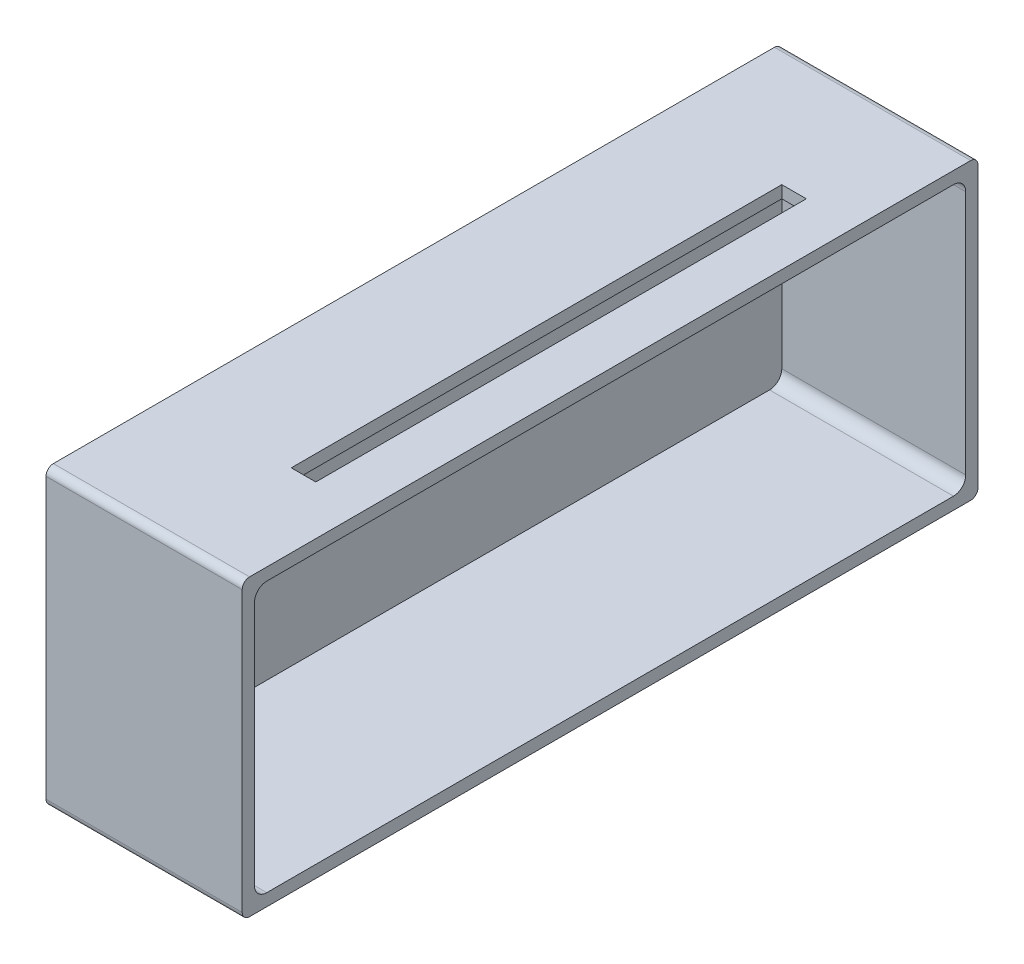
ISO-10303-21;
HEADER;
FILE_DESCRIPTION(('STEP AP214'),'2;1');
FILE_NAME('part.step','',(''),(''),'','','');
FILE_SCHEMA(('AUTOMOTIVE_DESIGN { 1 0 10303 214 1 1 1 1 }'));
ENDSEC;
DATA;
#1=APPLICATION_CONTEXT('core data for automotive mechanical design processes');
#2=APPLICATION_PROTOCOL_DEFINITION('international standard','automotive_design',2000,#1);
#3=PRODUCT_CONTEXT('',#1,'mechanical');
#4=PRODUCT('Part','Part','',(#3));
#5=PRODUCT_RELATED_PRODUCT_CATEGORY('part','',(#4));
#6=PRODUCT_DEFINITION_FORMATION('','',#4);
#7=PRODUCT_DEFINITION_CONTEXT('part definition',#1,'design');
#8=PRODUCT_DEFINITION('design','',#6,#7);
#9=PRODUCT_DEFINITION_SHAPE('','',#8);
#10=(LENGTH_UNIT() NAMED_UNIT(*) SI_UNIT(.MILLI.,.METRE.));
#11=(NAMED_UNIT(*) PLANE_ANGLE_UNIT() SI_UNIT($,.RADIAN.));
#12=(NAMED_UNIT(*) SI_UNIT($,.STERADIAN.) SOLID_ANGLE_UNIT());
#13=UNCERTAINTY_MEASURE_WITH_UNIT(LENGTH_MEASURE(1.E-05),#10,'distance_accuracy_value','');
#14=(GEOMETRIC_REPRESENTATION_CONTEXT(3) GLOBAL_UNCERTAINTY_ASSIGNED_CONTEXT((#13)) GLOBAL_UNIT_ASSIGNED_CONTEXT((#10,
#11,#12)) REPRESENTATION_CONTEXT('',''));
#15=CARTESIAN_POINT('',(0.,0.,0.));
#16=DIRECTION('',(0.,0.,1.));
#17=DIRECTION('',(1.,0.,0.));
#18=AXIS2_PLACEMENT_3D('',#15,#16,#17);
#19=CARTESIAN_POINT('',(80.,127.850176246966,146.991542380905));
#20=DIRECTION('',(0.,0.,-1.));
#21=DIRECTION('',(-1.,0.,0.));
#22=AXIS2_PLACEMENT_3D('',#19,#20,#21);
#23=PLANE('',#22);
#24=DIRECTION('',(0.,-1.,0.));
#25=VECTOR('',#24,1.);
#26=CARTESIAN_POINT('',(0.,127.850176246966,146.991542380905));
#27=LINE('',#26,#25);
#28=CARTESIAN_POINT('',(0.,124.850176246966,146.991542380905));
#29=VERTEX_POINT('',#28);
#30=CARTESIAN_POINT('',(0.,10.8501762469659,146.991542380905));
#31=VERTEX_POINT('',#30);
#32=EDGE_CURVE('E264',#29,#31,#27,.T.);
#33=ORIENTED_EDGE('',*,*,#32,.T.);
#34=DIRECTION('',(-1.,0.,0.));
#35=VECTOR('',#34,1.);
#36=CARTESIAN_POINT('',(80.,10.8501762469659,146.991542380905));
#37=LINE('',#36,#35);
#38=CARTESIAN_POINT('',(80.,10.8501762469659,146.991542380905));
#39=VERTEX_POINT('',#38);
#40=EDGE_CURVE('E338',#31,#39,#37,.F.);
#41=ORIENTED_EDGE('',*,*,#40,.T.);
#42=DIRECTION('',(0.,-1.,0.));
#43=VECTOR('',#42,1.);
#44=CARTESIAN_POINT('',(80.,127.850176246966,146.991542380905));
#45=LINE('',#44,#43);
#46=CARTESIAN_POINT('',(80.,124.850176246966,146.991542380905));
#47=VERTEX_POINT('',#46);
#48=EDGE_CURVE('E265',#47,#39,#45,.T.);
#49=ORIENTED_EDGE('',*,*,#48,.F.);
#50=DIRECTION('',(-1.,0.,0.));
#51=VECTOR('',#50,1.);
#52=CARTESIAN_POINT('',(80.,124.850176246966,146.991542380905));
#53=LINE('',#52,#51);
#54=EDGE_CURVE('E334',#47,#29,#53,.T.);
#55=ORIENTED_EDGE('',*,*,#54,.T.);
#56=EDGE_LOOP('',(#33,#41,#49,#55));
#57=FACE_BOUND('',#56,.T.);
#58=ADVANCED_FACE('F47',(#57),#23,.F.);
#59=CARTESIAN_POINT('',(80.,7.85017624696593,146.991542380905));
#60=DIRECTION('',(0.,1.,0.));
#61=DIRECTION('',(0.,0.,1.));
#62=AXIS2_PLACEMENT_3D('',#59,#60,#61);
#63=PLANE('',#62);
#64=DIRECTION('',(0.,0.,-1.));
#65=VECTOR('',#64,1.);
#66=CARTESIAN_POINT('',(0.,7.85017624696593,146.991542380905));
#67=LINE('',#66,#65);
#68=CARTESIAN_POINT('',(0.,7.85017624696593,143.991542380905));
#69=VERTEX_POINT('',#68);
#70=CARTESIAN_POINT('',(0.,7.85017624696593,-150.008457619095));
#71=VERTEX_POINT('',#70);
#72=EDGE_CURVE('E286',#69,#71,#67,.T.);
#73=ORIENTED_EDGE('',*,*,#72,.T.);
#74=DIRECTION('',(-1.,0.,0.));
#75=VECTOR('',#74,1.);
#76=CARTESIAN_POINT('',(80.,7.85017624696593,-150.008457619095));
#77=LINE('',#76,#75);
#78=CARTESIAN_POINT('',(80.,7.85017624696593,-150.008457619095));
#79=VERTEX_POINT('',#78);
#80=EDGE_CURVE('E319',#71,#79,#77,.F.);
#81=ORIENTED_EDGE('',*,*,#80,.T.);
#82=DIRECTION('',(0.,0.,-1.));
#83=VECTOR('',#82,1.);
#84=CARTESIAN_POINT('',(80.,7.85017624696593,146.991542380905));
#85=LINE('',#84,#83);
#86=CARTESIAN_POINT('',(80.,7.85017624696593,143.991542380905));
#87=VERTEX_POINT('',#86);
#88=EDGE_CURVE('E269',#87,#79,#85,.T.);
#89=ORIENTED_EDGE('',*,*,#88,.F.);
#90=DIRECTION('',(-1.,0.,0.));
#91=VECTOR('',#90,1.);
#92=CARTESIAN_POINT('',(80.,7.85017624696593,143.991542380905));
#93=LINE('',#92,#91);
#94=EDGE_CURVE('E315',#87,#69,#93,.T.);
#95=ORIENTED_EDGE('',*,*,#94,.T.);
#96=EDGE_LOOP('',(#73,#81,#89,#95));
#97=FACE_BOUND('',#96,.T.);
#98=ADVANCED_FACE('F440',(#97),#63,.F.);
#99=CARTESIAN_POINT('',(80.,127.850176246966,-153.008457619095));
#100=DIRECTION('',(0.,0.,1.));
#101=DIRECTION('',(0.,-1.,0.));
#102=AXIS2_PLACEMENT_3D('',#99,#100,#101);
#103=PLANE('',#102);
#104=DIRECTION('',(0.,1.,0.));
#105=VECTOR('',#104,1.);
#106=CARTESIAN_POINT('',(80.,127.850176246966,-153.008457619095));
#107=LINE('',#106,#105);
#108=CARTESIAN_POINT('',(80.,10.8501762469659,-153.008457619095));
#109=VERTEX_POINT('',#108);
#110=CARTESIAN_POINT('',(80.,124.850176246966,-153.008457619095));
#111=VERTEX_POINT('',#110);
#112=EDGE_CURVE('E274',#109,#111,#107,.T.);
#113=ORIENTED_EDGE('',*,*,#112,.F.);
#114=DIRECTION('',(-1.,0.,0.));
#115=VECTOR('',#114,1.);
#116=CARTESIAN_POINT('',(80.,10.8501762469659,-153.008457619095));
#117=LINE('',#116,#115);
#118=CARTESIAN_POINT('',(0.,10.8501762469659,-153.008457619095));
#119=VERTEX_POINT('',#118);
#120=EDGE_CURVE('E299',#109,#119,#117,.T.);
#121=ORIENTED_EDGE('',*,*,#120,.T.);
#122=DIRECTION('',(0.,1.,0.));
#123=VECTOR('',#122,1.);
#124=CARTESIAN_POINT('',(0.,127.850176246966,-153.008457619095));
#125=LINE('',#124,#123);
#126=CARTESIAN_POINT('',(0.,124.850176246966,-153.008457619095));
#127=VERTEX_POINT('',#126);
#128=EDGE_CURVE('E290',#119,#127,#125,.T.);
#129=ORIENTED_EDGE('',*,*,#128,.T.);
#130=DIRECTION('',(-1.,0.,0.));
#131=VECTOR('',#130,1.);
#132=CARTESIAN_POINT('',(80.,124.850176246966,-153.008457619095));
#133=LINE('',#132,#131);
#134=EDGE_CURVE('E282',#127,#111,#133,.F.);
#135=ORIENTED_EDGE('',*,*,#134,.T.);
#136=EDGE_LOOP('',(#113,#121,#129,#135));
#137=FACE_BOUND('',#136,.T.);
#138=ADVANCED_FACE('F446',(#137),#103,.F.);
#139=CARTESIAN_POINT('',(80.,127.850176246966,146.991542380905));
#140=DIRECTION('',(0.,-1.,0.));
#141=DIRECTION('',(0.,0.,-1.));
#142=AXIS2_PLACEMENT_3D('',#139,#140,#141);
#143=PLANE('',#142);
#144=DIRECTION('',(1.,0.,0.));
#145=VECTOR('',#144,1.);
#146=CARTESIAN_POINT('',(50.,127.850176246966,96.9915423809052));
#147=LINE('',#146,#145);
#148=CARTESIAN_POINT('',(50.,127.850176246966,96.9915423809052));
#149=VERTEX_POINT('',#148);
#150=CARTESIAN_POINT('',(60.,127.850176246966,96.9915423809052));
#151=VERTEX_POINT('',#150);
#152=EDGE_CURVE('E218',#149,#151,#147,.T.);
#153=ORIENTED_EDGE('',*,*,#152,.F.);
#154=DIRECTION('',(0.,0.,1.));
#155=VECTOR('',#154,1.);
#156=CARTESIAN_POINT('',(50.,127.850176246966,-103.008457619095));
#157=LINE('',#156,#155);
#158=CARTESIAN_POINT('',(50.,127.850176246966,-103.008457619095));
#159=VERTEX_POINT('',#158);
#160=EDGE_CURVE('E63',#159,#149,#157,.T.);
#161=ORIENTED_EDGE('',*,*,#160,.F.);
#162=DIRECTION('',(-1.,0.,0.));
#163=VECTOR('',#162,1.);
#164=CARTESIAN_POINT('',(50.,127.850176246966,-103.008457619095));
#165=LINE('',#164,#163);
#166=CARTESIAN_POINT('',(60.,127.850176246966,-103.008457619095));
#167=VERTEX_POINT('',#166);
#168=EDGE_CURVE('E205',#167,#159,#165,.T.);
#169=ORIENTED_EDGE('',*,*,#168,.F.);
#170=DIRECTION('',(0.,0.,-1.));
#171=VECTOR('',#170,1.);
#172=CARTESIAN_POINT('',(60.,127.850176246966,-103.008457619095));
#173=LINE('',#172,#171);
#174=EDGE_CURVE('E209',#151,#167,#173,.T.);
#175=ORIENTED_EDGE('',*,*,#174,.F.);
#176=EDGE_LOOP('',(#153,#161,#169,#175));
#177=FACE_BOUND('',#176,.T.);
#178=DIRECTION('',(0.,0.,1.));
#179=VECTOR('',#178,1.);
#180=CARTESIAN_POINT('',(80.,127.850176246966,146.991542380905));
#181=LINE('',#180,#179);
#182=CARTESIAN_POINT('',(80.,127.850176246966,-150.008457619095));
#183=VERTEX_POINT('',#182);
#184=CARTESIAN_POINT('',(80.,127.850176246966,143.991542380905));
#185=VERTEX_POINT('',#184);
#186=EDGE_CURVE('E278',#183,#185,#181,.T.);
#187=ORIENTED_EDGE('',*,*,#186,.F.);
#188=DIRECTION('',(-1.,0.,0.));
#189=VECTOR('',#188,1.);
#190=CARTESIAN_POINT('',(80.,127.850176246966,-150.008457619095));
#191=LINE('',#190,#189);
#192=CARTESIAN_POINT('',(0.,127.850176246966,-150.008457619095));
#193=VERTEX_POINT('',#192);
#194=EDGE_CURVE('E344',#183,#193,#191,.T.);
#195=ORIENTED_EDGE('',*,*,#194,.T.);
#196=DIRECTION('',(0.,0.,1.));
#197=VECTOR('',#196,1.);
#198=CARTESIAN_POINT('',(0.,127.850176246966,146.991542380905));
#199=LINE('',#198,#197);
#200=CARTESIAN_POINT('',(0.,127.850176246966,143.991542380905));
#201=VERTEX_POINT('',#200);
#202=EDGE_CURVE('E270',#193,#201,#199,.T.);
#203=ORIENTED_EDGE('',*,*,#202,.T.);
#204=DIRECTION('',(-1.,0.,0.));
#205=VECTOR('',#204,1.);
#206=CARTESIAN_POINT('',(80.,127.850176246966,143.991542380905));
#207=LINE('',#206,#205);
#208=EDGE_CURVE('E341',#201,#185,#207,.F.);
#209=ORIENTED_EDGE('',*,*,#208,.T.);
#210=EDGE_LOOP('',(#187,#195,#203,#209));
#211=FACE_BOUND('',#210,.T.);
#212=ADVANCED_FACE('F492',(#177,#211),#143,.F.);
#213=CARTESIAN_POINT('',(80.,0.,0.));
#214=DIRECTION('',(1.,0.,0.));
#215=DIRECTION('',(0.,0.,-1.));
#216=AXIS2_PLACEMENT_3D('',#213,#214,#215);
#217=PLANE('',#216);
#218=DIRECTION('',(0.,0.,-1.));
#219=VECTOR('',#218,1.);
#220=CARTESIAN_POINT('',(80.,12.8501762469659,146.991542380905));
#221=LINE('',#220,#219);
#222=CARTESIAN_POINT('',(80.,12.8501762469659,136.991542380905));
#223=VERTEX_POINT('',#222);
#224=CARTESIAN_POINT('',(80.,12.8501762469659,-143.008457619095));
#225=VERTEX_POINT('',#224);
#226=EDGE_CURVE('E252',#223,#225,#221,.T.);
#227=ORIENTED_EDGE('',*,*,#226,.F.);
#228=CARTESIAN_POINT('',(80.,17.8501762469659,136.991542380905));
#229=DIRECTION('',(1.,0.,0.));
#230=DIRECTION('',(0.,0.,-1.));
#231=AXIS2_PLACEMENT_3D('',#228,#229,#230);
#232=CIRCLE('',#231,5.);
#233=CARTESIAN_POINT('',(80.,17.8501762469659,141.991542380905));
#234=VERTEX_POINT('',#233);
#235=EDGE_CURVE('E388',#223,#234,#232,.F.);
#236=ORIENTED_EDGE('',*,*,#235,.T.);
#237=DIRECTION('',(0.,-1.,0.));
#238=VECTOR('',#237,1.);
#239=CARTESIAN_POINT('',(80.,127.850176246966,141.991542380905));
#240=LINE('',#239,#238);
#241=CARTESIAN_POINT('',(80.,117.850176246966,141.991542380905));
#242=VERTEX_POINT('',#241);
#243=EDGE_CURVE('E248',#242,#234,#240,.T.);
#244=ORIENTED_EDGE('',*,*,#243,.F.);
#245=CARTESIAN_POINT('',(80.,117.850176246966,136.991542380905));
#246=DIRECTION('',(1.,0.,0.));
#247=DIRECTION('',(0.,0.,-1.));
#248=AXIS2_PLACEMENT_3D('',#245,#246,#247);
#249=CIRCLE('',#248,5.);
#250=CARTESIAN_POINT('',(80.,122.850176246966,136.991542380905));
#251=VERTEX_POINT('',#250);
#252=EDGE_CURVE('E11',#242,#251,#249,.F.);
#253=ORIENTED_EDGE('',*,*,#252,.T.);
#254=DIRECTION('',(0.,0.,1.));
#255=VECTOR('',#254,1.);
#256=CARTESIAN_POINT('',(80.,122.850176246966,146.991542380905));
#257=LINE('',#256,#255);
#258=CARTESIAN_POINT('',(80.,122.850176246966,-143.008457619095));
#259=VERTEX_POINT('',#258);
#260=EDGE_CURVE('E260',#259,#251,#257,.T.);
#261=ORIENTED_EDGE('',*,*,#260,.F.);
#262=CARTESIAN_POINT('',(80.,117.850176246966,-143.008457619095));
#263=DIRECTION('',(1.,0.,0.));
#264=DIRECTION('',(0.,0.,-1.));
#265=AXIS2_PLACEMENT_3D('',#262,#263,#264);
#266=CIRCLE('',#265,5.);
#267=CARTESIAN_POINT('',(80.,117.850176246966,-148.008457619095));
#268=VERTEX_POINT('',#267);
#269=EDGE_CURVE('E56',#259,#268,#266,.F.);
#270=ORIENTED_EDGE('',*,*,#269,.T.);
#271=DIRECTION('',(0.,1.,0.));
#272=VECTOR('',#271,1.);
#273=CARTESIAN_POINT('',(80.,127.850176246966,-148.008457619095));
#274=LINE('',#273,#272);
#275=CARTESIAN_POINT('',(80.,17.8501762469659,-148.008457619095));
#276=VERTEX_POINT('',#275);
#277=EDGE_CURVE('E256',#276,#268,#274,.T.);
#278=ORIENTED_EDGE('',*,*,#277,.F.);
#279=CARTESIAN_POINT('',(80.,17.8501762469659,-143.008457619095));
#280=DIRECTION('',(1.,0.,0.));
#281=DIRECTION('',(0.,0.,-1.));
#282=AXIS2_PLACEMENT_3D('',#279,#280,#281);
#283=CIRCLE('',#282,5.);
#284=EDGE_CURVE('E391',#276,#225,#283,.F.);
#285=ORIENTED_EDGE('',*,*,#284,.T.);
#286=EDGE_LOOP('',(#227,#236,#244,#253,#261,#270,#278,#285));
#287=FACE_BOUND('',#286,.T.);
#288=ORIENTED_EDGE('',*,*,#88,.T.);
#289=CARTESIAN_POINT('',(80.,10.8501762469659,-150.008457619095));
#290=DIRECTION('',(1.,0.,0.));
#291=DIRECTION('',(0.,0.,-1.));
#292=AXIS2_PLACEMENT_3D('',#289,#290,#291);
#293=CIRCLE('',#292,3.);
#294=EDGE_CURVE('E331',#79,#109,#293,.T.);
#295=ORIENTED_EDGE('',*,*,#294,.T.);
#296=ORIENTED_EDGE('',*,*,#112,.T.);
#297=CARTESIAN_POINT('',(80.,124.850176246966,-150.008457619095));
#298=DIRECTION('',(1.,0.,0.));
#299=DIRECTION('',(0.,0.,-1.));
#300=AXIS2_PLACEMENT_3D('',#297,#298,#299);
#301=CIRCLE('',#300,3.);
#302=EDGE_CURVE('E325',#111,#183,#301,.T.);
#303=ORIENTED_EDGE('',*,*,#302,.T.);
#304=ORIENTED_EDGE('',*,*,#186,.T.);
#305=CARTESIAN_POINT('',(80.,124.850176246966,143.991542380905));
#306=DIRECTION('',(1.,0.,0.));
#307=DIRECTION('',(0.,0.,-1.));
#308=AXIS2_PLACEMENT_3D('',#305,#306,#307);
#309=CIRCLE('',#308,3.);
#310=EDGE_CURVE('E322',#185,#47,#309,.T.);
#311=ORIENTED_EDGE('',*,*,#310,.T.);
#312=ORIENTED_EDGE('',*,*,#48,.T.);
#313=CARTESIAN_POINT('',(80.,10.8501762469659,143.991542380905));
#314=DIRECTION('',(1.,0.,0.));
#315=DIRECTION('',(0.,0.,-1.));
#316=AXIS2_PLACEMENT_3D('',#313,#314,#315);
#317=CIRCLE('',#316,3.);
#318=EDGE_CURVE('E328',#39,#87,#317,.T.);
#319=ORIENTED_EDGE('',*,*,#318,.T.);
#320=EDGE_LOOP('',(#288,#295,#296,#303,#304,#311,#312,#319));
#321=FACE_BOUND('',#320,.T.);
#322=ADVANCED_FACE('F398',(#287,#321),#217,.T.);
#323=CARTESIAN_POINT('',(0.,0.,0.));
#324=DIRECTION('',(1.,0.,0.));
#325=DIRECTION('',(0.,0.,-1.));
#326=AXIS2_PLACEMENT_3D('',#323,#324,#325);
#327=PLANE('',#326);
#328=ORIENTED_EDGE('',*,*,#128,.F.);
#329=CARTESIAN_POINT('',(0.,10.8501762469659,-150.008457619095));
#330=DIRECTION('',(1.,0.,0.));
#331=DIRECTION('',(0.,0.,-1.));
#332=AXIS2_PLACEMENT_3D('',#329,#330,#331);
#333=CIRCLE('',#332,3.);
#334=EDGE_CURVE('E312',#119,#71,#333,.F.);
#335=ORIENTED_EDGE('',*,*,#334,.T.);
#336=ORIENTED_EDGE('',*,*,#72,.F.);
#337=CARTESIAN_POINT('',(0.,10.8501762469659,143.991542380905));
#338=DIRECTION('',(1.,0.,0.));
#339=DIRECTION('',(0.,0.,-1.));
#340=AXIS2_PLACEMENT_3D('',#337,#338,#339);
#341=CIRCLE('',#340,3.);
#342=EDGE_CURVE('E309',#69,#31,#341,.F.);
#343=ORIENTED_EDGE('',*,*,#342,.T.);
#344=ORIENTED_EDGE('',*,*,#32,.F.);
#345=CARTESIAN_POINT('',(0.,124.850176246966,143.991542380905));
#346=DIRECTION('',(1.,0.,0.));
#347=DIRECTION('',(0.,0.,-1.));
#348=AXIS2_PLACEMENT_3D('',#345,#346,#347);
#349=CIRCLE('',#348,3.);
#350=EDGE_CURVE('E303',#29,#201,#349,.F.);
#351=ORIENTED_EDGE('',*,*,#350,.T.);
#352=ORIENTED_EDGE('',*,*,#202,.F.);
#353=CARTESIAN_POINT('',(0.,124.850176246966,-150.008457619095));
#354=DIRECTION('',(1.,0.,0.));
#355=DIRECTION('',(0.,0.,-1.));
#356=AXIS2_PLACEMENT_3D('',#353,#354,#355);
#357=CIRCLE('',#356,3.);
#358=EDGE_CURVE('E306',#193,#127,#357,.F.);
#359=ORIENTED_EDGE('',*,*,#358,.T.);
#360=EDGE_LOOP('',(#328,#335,#336,#343,#344,#351,#352,#359));
#361=FACE_BOUND('',#360,.T.);
#362=ADVANCED_FACE('F455',(#361),#327,.F.);
#363=CARTESIAN_POINT('',(80.,10.8501762469659,-150.008457619095));
#364=DIRECTION('',(-1.,0.,0.));
#365=DIRECTION('',(0.,0.,1.));
#366=AXIS2_PLACEMENT_3D('',#363,#364,#365);
#367=CYLINDRICAL_SURFACE('',#366,3.);
#368=ORIENTED_EDGE('',*,*,#294,.F.);
#369=ORIENTED_EDGE('',*,*,#80,.F.);
#370=ORIENTED_EDGE('',*,*,#334,.F.);
#371=ORIENTED_EDGE('',*,*,#120,.F.);
#372=EDGE_LOOP('',(#368,#369,#370,#371));
#373=FACE_BOUND('',#372,.T.);
#374=ADVANCED_FACE('F451',(#373),#367,.T.);
#375=CARTESIAN_POINT('',(80.,10.8501762469659,143.991542380905));
#376=DIRECTION('',(-1.,0.,0.));
#377=DIRECTION('',(0.,0.,1.));
#378=AXIS2_PLACEMENT_3D('',#375,#376,#377);
#379=CYLINDRICAL_SURFACE('',#378,3.);
#380=ORIENTED_EDGE('',*,*,#318,.F.);
#381=ORIENTED_EDGE('',*,*,#40,.F.);
#382=ORIENTED_EDGE('',*,*,#342,.F.);
#383=ORIENTED_EDGE('',*,*,#94,.F.);
#384=EDGE_LOOP('',(#380,#381,#382,#383));
#385=FACE_BOUND('',#384,.T.);
#386=ADVANCED_FACE('F454',(#385),#379,.T.);
#387=CARTESIAN_POINT('',(80.,124.850176246966,-150.008457619095));
#388=DIRECTION('',(-1.,0.,0.));
#389=DIRECTION('',(0.,0.,1.));
#390=AXIS2_PLACEMENT_3D('',#387,#388,#389);
#391=CYLINDRICAL_SURFACE('',#390,3.);
#392=ORIENTED_EDGE('',*,*,#302,.F.);
#393=ORIENTED_EDGE('',*,*,#134,.F.);
#394=ORIENTED_EDGE('',*,*,#358,.F.);
#395=ORIENTED_EDGE('',*,*,#194,.F.);
#396=EDGE_LOOP('',(#392,#393,#394,#395));
#397=FACE_BOUND('',#396,.T.);
#398=ADVANCED_FACE('F459',(#397),#391,.T.);
#399=CARTESIAN_POINT('',(80.,124.850176246966,143.991542380905));
#400=DIRECTION('',(-1.,0.,0.));
#401=DIRECTION('',(0.,0.,1.));
#402=AXIS2_PLACEMENT_3D('',#399,#400,#401);
#403=CYLINDRICAL_SURFACE('',#402,3.);
#404=ORIENTED_EDGE('',*,*,#310,.F.);
#405=ORIENTED_EDGE('',*,*,#208,.F.);
#406=ORIENTED_EDGE('',*,*,#350,.F.);
#407=ORIENTED_EDGE('',*,*,#54,.F.);
#408=EDGE_LOOP('',(#404,#405,#406,#407));
#409=FACE_BOUND('',#408,.T.);
#410=ADVANCED_FACE('F463',(#409),#403,.T.);
#411=CARTESIAN_POINT('',(80.,127.850176246966,141.991542380905));
#412=DIRECTION('',(0.,0.,-1.));
#413=DIRECTION('',(-1.,0.,0.));
#414=AXIS2_PLACEMENT_3D('',#411,#412,#413);
#415=PLANE('',#414);
#416=ORIENTED_EDGE('',*,*,#243,.T.);
#417=DIRECTION('',(1.,0.,0.));
#418=VECTOR('',#417,1.);
#419=CARTESIAN_POINT('',(5.,17.8501762469659,141.991542380905));
#420=LINE('',#419,#418);
#421=CARTESIAN_POINT('',(5.,17.8501762469659,141.991542380905));
#422=VERTEX_POINT('',#421);
#423=EDGE_CURVE('E359',#234,#422,#420,.F.);
#424=ORIENTED_EDGE('',*,*,#423,.T.);
#425=DIRECTION('',(0.,-1.,0.));
#426=VECTOR('',#425,1.);
#427=CARTESIAN_POINT('',(5.,127.850176246966,141.991542380905));
#428=LINE('',#427,#426);
#429=CARTESIAN_POINT('',(5.,117.850176246966,141.991542380905));
#430=VERTEX_POINT('',#429);
#431=EDGE_CURVE('E227',#430,#422,#428,.T.);
#432=ORIENTED_EDGE('',*,*,#431,.F.);
#433=DIRECTION('',(1.,0.,0.));
#434=VECTOR('',#433,1.);
#435=CARTESIAN_POINT('',(80.,117.850176246966,141.991542380905));
#436=LINE('',#435,#434);
#437=EDGE_CURVE('E355',#430,#242,#436,.T.);
#438=ORIENTED_EDGE('',*,*,#437,.T.);
#439=EDGE_LOOP('',(#416,#424,#432,#438));
#440=FACE_BOUND('',#439,.T.);
#441=ADVANCED_FACE('F419',(#440),#415,.T.);
#442=CARTESIAN_POINT('',(80.,12.8501762469659,146.991542380905));
#443=DIRECTION('',(0.,1.,0.));
#444=DIRECTION('',(0.,0.,1.));
#445=AXIS2_PLACEMENT_3D('',#442,#443,#444);
#446=PLANE('',#445);
#447=DIRECTION('',(0.,0.,-1.));
#448=VECTOR('',#447,1.);
#449=CARTESIAN_POINT('',(5.,12.8501762469659,146.991542380905));
#450=LINE('',#449,#448);
#451=CARTESIAN_POINT('',(5.,12.8501762469659,136.991542380905));
#452=VERTEX_POINT('',#451);
#453=CARTESIAN_POINT('',(5.,12.8501762469659,-143.008457619095));
#454=VERTEX_POINT('',#453);
#455=EDGE_CURVE('E236',#452,#454,#450,.T.);
#456=ORIENTED_EDGE('',*,*,#455,.F.);
#457=DIRECTION('',(1.,0.,0.));
#458=VECTOR('',#457,1.);
#459=CARTESIAN_POINT('',(80.,12.8501762469659,136.991542380905));
#460=LINE('',#459,#458);
#461=EDGE_CURVE('E351',#452,#223,#460,.T.);
#462=ORIENTED_EDGE('',*,*,#461,.T.);
#463=ORIENTED_EDGE('',*,*,#226,.T.);
#464=DIRECTION('',(1.,0.,0.));
#465=VECTOR('',#464,1.);
#466=CARTESIAN_POINT('',(5.,12.8501762469659,-143.008457619095));
#467=LINE('',#466,#465);
#468=EDGE_CURVE('E348',#225,#454,#467,.F.);
#469=ORIENTED_EDGE('',*,*,#468,.T.);
#470=EDGE_LOOP('',(#456,#462,#463,#469));
#471=FACE_BOUND('',#470,.T.);
#472=ADVANCED_FACE('F428',(#471),#446,.T.);
#473=CARTESIAN_POINT('',(80.,127.850176246966,-148.008457619095));
#474=DIRECTION('',(0.,0.,1.));
#475=DIRECTION('',(0.,-1.,0.));
#476=AXIS2_PLACEMENT_3D('',#473,#474,#475);
#477=PLANE('',#476);
#478=DIRECTION('',(0.,1.,0.));
#479=VECTOR('',#478,1.);
#480=CARTESIAN_POINT('',(5.,127.850176246966,-148.008457619095));
#481=LINE('',#480,#479);
#482=CARTESIAN_POINT('',(5.,17.8501762469659,-148.008457619095));
#483=VERTEX_POINT('',#482);
#484=CARTESIAN_POINT('',(5.,117.850176246966,-148.008457619095));
#485=VERTEX_POINT('',#484);
#486=EDGE_CURVE('E240',#483,#485,#481,.T.);
#487=ORIENTED_EDGE('',*,*,#486,.F.);
#488=DIRECTION('',(1.,0.,0.));
#489=VECTOR('',#488,1.);
#490=CARTESIAN_POINT('',(80.,17.8501762469659,-148.008457619095));
#491=LINE('',#490,#489);
#492=EDGE_CURVE('E377',#483,#276,#491,.T.);
#493=ORIENTED_EDGE('',*,*,#492,.T.);
#494=ORIENTED_EDGE('',*,*,#277,.T.);
#495=DIRECTION('',(1.,0.,0.));
#496=VECTOR('',#495,1.);
#497=CARTESIAN_POINT('',(5.,117.850176246966,-148.008457619095));
#498=LINE('',#497,#496);
#499=EDGE_CURVE('E374',#268,#485,#498,.F.);
#500=ORIENTED_EDGE('',*,*,#499,.T.);
#501=EDGE_LOOP('',(#487,#493,#494,#500));
#502=FACE_BOUND('',#501,.T.);
#503=ADVANCED_FACE('F405',(#502),#477,.T.);
#504=CARTESIAN_POINT('',(80.,122.850176246966,146.991542380905));
#505=DIRECTION('',(0.,-1.,0.));
#506=DIRECTION('',(0.,0.,-1.));
#507=AXIS2_PLACEMENT_3D('',#504,#505,#506);
#508=PLANE('',#507);
#509=DIRECTION('',(0.,0.,1.));
#510=VECTOR('',#509,1.);
#511=CARTESIAN_POINT('',(50.,122.850176246966,-103.008457619095));
#512=LINE('',#511,#510);
#513=CARTESIAN_POINT('',(50.,122.850176246966,-103.008457619095));
#514=VERTEX_POINT('',#513);
#515=CARTESIAN_POINT('',(50.,122.850176246966,96.9915423809052));
#516=VERTEX_POINT('',#515);
#517=EDGE_CURVE('E186',#514,#516,#512,.T.);
#518=ORIENTED_EDGE('',*,*,#517,.T.);
#519=DIRECTION('',(1.,0.,0.));
#520=VECTOR('',#519,1.);
#521=CARTESIAN_POINT('',(50.,122.850176246966,96.9915423809052));
#522=LINE('',#521,#520);
#523=CARTESIAN_POINT('',(60.,122.850176246966,96.9915423809052));
#524=VERTEX_POINT('',#523);
#525=EDGE_CURVE('E196',#516,#524,#522,.T.);
#526=ORIENTED_EDGE('',*,*,#525,.T.);
#527=DIRECTION('',(0.,0.,-1.));
#528=VECTOR('',#527,1.);
#529=CARTESIAN_POINT('',(60.,122.850176246966,-103.008457619095));
#530=LINE('',#529,#528);
#531=CARTESIAN_POINT('',(60.,122.850176246966,-103.008457619095));
#532=VERTEX_POINT('',#531);
#533=EDGE_CURVE('E71',#524,#532,#530,.T.);
#534=ORIENTED_EDGE('',*,*,#533,.T.);
#535=DIRECTION('',(-1.,0.,0.));
#536=VECTOR('',#535,1.);
#537=CARTESIAN_POINT('',(50.,122.850176246966,-103.008457619095));
#538=LINE('',#537,#536);
#539=EDGE_CURVE('E193',#532,#514,#538,.T.);
#540=ORIENTED_EDGE('',*,*,#539,.T.);
#541=EDGE_LOOP('',(#518,#526,#534,#540));
#542=FACE_BOUND('',#541,.T.);
#543=DIRECTION('',(0.,0.,1.));
#544=VECTOR('',#543,1.);
#545=CARTESIAN_POINT('',(5.,122.850176246966,146.991542380905));
#546=LINE('',#545,#544);
#547=CARTESIAN_POINT('',(5.,122.850176246966,-143.008457619095));
#548=VERTEX_POINT('',#547);
#549=CARTESIAN_POINT('',(5.,122.850176246966,136.991542380905));
#550=VERTEX_POINT('',#549);
#551=EDGE_CURVE('E244',#548,#550,#546,.T.);
#552=ORIENTED_EDGE('',*,*,#551,.F.);
#553=DIRECTION('',(1.,0.,0.));
#554=VECTOR('',#553,1.);
#555=CARTESIAN_POINT('',(80.,122.850176246966,-143.008457619095));
#556=LINE('',#555,#554);
#557=EDGE_CURVE('E384',#548,#259,#556,.T.);
#558=ORIENTED_EDGE('',*,*,#557,.T.);
#559=ORIENTED_EDGE('',*,*,#260,.T.);
#560=DIRECTION('',(1.,0.,0.));
#561=VECTOR('',#560,1.);
#562=CARTESIAN_POINT('',(5.,122.850176246966,136.991542380905));
#563=LINE('',#562,#561);
#564=EDGE_CURVE('E381',#251,#550,#563,.F.);
#565=ORIENTED_EDGE('',*,*,#564,.T.);
#566=EDGE_LOOP('',(#552,#558,#559,#565));
#567=FACE_BOUND('',#566,.T.);
#568=ADVANCED_FACE('F201',(#542,#567),#508,.T.);
#569=CARTESIAN_POINT('',(5.,0.,0.));
#570=DIRECTION('',(1.,0.,0.));
#571=DIRECTION('',(0.,0.,-1.));
#572=AXIS2_PLACEMENT_3D('',#569,#570,#571);
#573=PLANE('',#572);
#574=ORIENTED_EDGE('',*,*,#431,.T.);
#575=CARTESIAN_POINT('',(5.,17.8501762469659,136.991542380905));
#576=DIRECTION('',(1.,0.,0.));
#577=DIRECTION('',(0.,0.,-1.));
#578=AXIS2_PLACEMENT_3D('',#575,#576,#577);
#579=CIRCLE('',#578,5.);
#580=EDGE_CURVE('E371',#422,#452,#579,.T.);
#581=ORIENTED_EDGE('',*,*,#580,.T.);
#582=ORIENTED_EDGE('',*,*,#455,.T.);
#583=CARTESIAN_POINT('',(5.,17.8501762469659,-143.008457619095));
#584=DIRECTION('',(1.,0.,0.));
#585=DIRECTION('',(0.,0.,-1.));
#586=AXIS2_PLACEMENT_3D('',#583,#584,#585);
#587=CIRCLE('',#586,5.);
#588=EDGE_CURVE('E368',#454,#483,#587,.T.);
#589=ORIENTED_EDGE('',*,*,#588,.T.);
#590=ORIENTED_EDGE('',*,*,#486,.T.);
#591=CARTESIAN_POINT('',(5.,117.850176246966,-143.008457619095));
#592=DIRECTION('',(1.,0.,0.));
#593=DIRECTION('',(0.,0.,-1.));
#594=AXIS2_PLACEMENT_3D('',#591,#592,#593);
#595=CIRCLE('',#594,5.);
#596=EDGE_CURVE('E365',#485,#548,#595,.T.);
#597=ORIENTED_EDGE('',*,*,#596,.T.);
#598=ORIENTED_EDGE('',*,*,#551,.T.);
#599=CARTESIAN_POINT('',(5.,117.850176246966,136.991542380905));
#600=DIRECTION('',(1.,0.,0.));
#601=DIRECTION('',(0.,0.,-1.));
#602=AXIS2_PLACEMENT_3D('',#599,#600,#601);
#603=CIRCLE('',#602,5.);
#604=EDGE_CURVE('E362',#550,#430,#603,.T.);
#605=ORIENTED_EDGE('',*,*,#604,.T.);
#606=EDGE_LOOP('',(#574,#581,#582,#589,#590,#597,#598,#605));
#607=FACE_BOUND('',#606,.T.);
#608=ADVANCED_FACE('F411',(#607),#573,.T.);
#609=CARTESIAN_POINT('',(80.,17.8501762469659,136.991542380905));
#610=DIRECTION('',(-1.,0.,0.));
#611=DIRECTION('',(0.,0.,1.));
#612=AXIS2_PLACEMENT_3D('',#609,#610,#611);
#613=CYLINDRICAL_SURFACE('',#612,5.);
#614=ORIENTED_EDGE('',*,*,#580,.F.);
#615=ORIENTED_EDGE('',*,*,#423,.F.);
#616=ORIENTED_EDGE('',*,*,#235,.F.);
#617=ORIENTED_EDGE('',*,*,#461,.F.);
#618=EDGE_LOOP('',(#614,#615,#616,#617));
#619=FACE_BOUND('',#618,.T.);
#620=ADVANCED_FACE('F423',(#619),#613,.F.);
#621=CARTESIAN_POINT('',(80.,17.8501762469659,-143.008457619095));
#622=DIRECTION('',(-1.,0.,0.));
#623=DIRECTION('',(0.,0.,1.));
#624=AXIS2_PLACEMENT_3D('',#621,#622,#623);
#625=CYLINDRICAL_SURFACE('',#624,5.);
#626=ORIENTED_EDGE('',*,*,#588,.F.);
#627=ORIENTED_EDGE('',*,*,#468,.F.);
#628=ORIENTED_EDGE('',*,*,#284,.F.);
#629=ORIENTED_EDGE('',*,*,#492,.F.);
#630=EDGE_LOOP('',(#626,#627,#628,#629));
#631=FACE_BOUND('',#630,.T.);
#632=ADVANCED_FACE('F431',(#631),#625,.F.);
#633=CARTESIAN_POINT('',(80.,117.850176246966,-143.008457619095));
#634=DIRECTION('',(-1.,0.,0.));
#635=DIRECTION('',(0.,0.,1.));
#636=AXIS2_PLACEMENT_3D('',#633,#634,#635);
#637=CYLINDRICAL_SURFACE('',#636,5.);
#638=ORIENTED_EDGE('',*,*,#596,.F.);
#639=ORIENTED_EDGE('',*,*,#499,.F.);
#640=ORIENTED_EDGE('',*,*,#269,.F.);
#641=ORIENTED_EDGE('',*,*,#557,.F.);
#642=EDGE_LOOP('',(#638,#639,#640,#641));
#643=FACE_BOUND('',#642,.T.);
#644=ADVANCED_FACE('F408',(#643),#637,.F.);
#645=CARTESIAN_POINT('',(80.,117.850176246966,136.991542380905));
#646=DIRECTION('',(-1.,0.,0.));
#647=DIRECTION('',(0.,0.,1.));
#648=AXIS2_PLACEMENT_3D('',#645,#646,#647);
#649=CYLINDRICAL_SURFACE('',#648,5.);
#650=ORIENTED_EDGE('',*,*,#604,.F.);
#651=ORIENTED_EDGE('',*,*,#564,.F.);
#652=ORIENTED_EDGE('',*,*,#252,.F.);
#653=ORIENTED_EDGE('',*,*,#437,.F.);
#654=EDGE_LOOP('',(#650,#651,#652,#653));
#655=FACE_BOUND('',#654,.T.);
#656=ADVANCED_FACE('F49',(#655),#649,.F.);
#657=CARTESIAN_POINT('',(50.,122.850176246966,-103.008457619095));
#658=DIRECTION('',(-1.,0.,0.));
#659=DIRECTION('',(0.,0.,1.));
#660=AXIS2_PLACEMENT_3D('',#657,#658,#659);
#661=PLANE('',#660);
#662=ORIENTED_EDGE('',*,*,#160,.T.);
#663=DIRECTION('',(0.,1.,0.));
#664=VECTOR('',#663,1.);
#665=CARTESIAN_POINT('',(50.,122.850176246966,96.9915423809052));
#666=LINE('',#665,#664);
#667=EDGE_CURVE('E182',#516,#149,#666,.T.);
#668=ORIENTED_EDGE('',*,*,#667,.F.);
#669=ORIENTED_EDGE('',*,*,#517,.F.);
#670=DIRECTION('',(0.,1.,0.));
#671=VECTOR('',#670,1.);
#672=CARTESIAN_POINT('',(50.,122.850176246966,-103.008457619095));
#673=LINE('',#672,#671);
#674=EDGE_CURVE('E224',#514,#159,#673,.T.);
#675=ORIENTED_EDGE('',*,*,#674,.T.);
#676=EDGE_LOOP('',(#662,#668,#669,#675));
#677=FACE_BOUND('',#676,.T.);
#678=ADVANCED_FACE('F184',(#677),#661,.F.);
#679=CARTESIAN_POINT('',(50.,122.850176246966,-103.008457619095));
#680=DIRECTION('',(0.,0.,-1.));
#681=DIRECTION('',(-1.,0.,0.));
#682=AXIS2_PLACEMENT_3D('',#679,#680,#681);
#683=PLANE('',#682);
#684=ORIENTED_EDGE('',*,*,#168,.T.);
#685=ORIENTED_EDGE('',*,*,#674,.F.);
#686=ORIENTED_EDGE('',*,*,#539,.F.);
#687=DIRECTION('',(0.,1.,0.));
#688=VECTOR('',#687,1.);
#689=CARTESIAN_POINT('',(60.,122.850176246966,-103.008457619095));
#690=LINE('',#689,#688);
#691=EDGE_CURVE('E228',#532,#167,#690,.T.);
#692=ORIENTED_EDGE('',*,*,#691,.T.);
#693=EDGE_LOOP('',(#684,#685,#686,#692));
#694=FACE_BOUND('',#693,.T.);
#695=ADVANCED_FACE('F633',(#694),#683,.F.);
#696=CARTESIAN_POINT('',(60.,122.850176246966,-103.008457619095));
#697=DIRECTION('',(1.,0.,0.));
#698=DIRECTION('',(0.,0.,-1.));
#699=AXIS2_PLACEMENT_3D('',#696,#697,#698);
#700=PLANE('',#699);
#701=ORIENTED_EDGE('',*,*,#174,.T.);
#702=ORIENTED_EDGE('',*,*,#691,.F.);
#703=ORIENTED_EDGE('',*,*,#533,.F.);
#704=DIRECTION('',(0.,1.,0.));
#705=VECTOR('',#704,1.);
#706=CARTESIAN_POINT('',(60.,122.850176246966,96.9915423809052));
#707=LINE('',#706,#705);
#708=EDGE_CURVE('E192',#524,#151,#707,.T.);
#709=ORIENTED_EDGE('',*,*,#708,.T.);
#710=EDGE_LOOP('',(#701,#702,#703,#709));
#711=FACE_BOUND('',#710,.T.);
#712=ADVANCED_FACE('F643',(#711),#700,.F.);
#713=CARTESIAN_POINT('',(50.,122.850176246966,96.9915423809052));
#714=DIRECTION('',(0.,0.,1.));
#715=DIRECTION('',(1.,0.,0.));
#716=AXIS2_PLACEMENT_3D('',#713,#714,#715);
#717=PLANE('',#716);
#718=ORIENTED_EDGE('',*,*,#152,.T.);
#719=ORIENTED_EDGE('',*,*,#708,.F.);
#720=ORIENTED_EDGE('',*,*,#525,.F.);
#721=ORIENTED_EDGE('',*,*,#667,.T.);
#722=EDGE_LOOP('',(#718,#719,#720,#721));
#723=FACE_BOUND('',#722,.T.);
#724=ADVANCED_FACE('F197',(#723),#717,.F.);
#725=CLOSED_SHELL('',(#58,#98,#138,#212,#322,#362,#374,#386,#398,#410,#441,#472,#503,#568,#608,
#620,#632,#644,#656,#678,#695,#712,#724));
#726=MANIFOLD_SOLID_BREP('B2',#725);
#727=ADVANCED_BREP_SHAPE_REPRESENTATION('',(#18,#726),#14);
#728=SHAPE_DEFINITION_REPRESENTATION(#9,#727);
ENDSEC;
END-ISO-10303-21;
